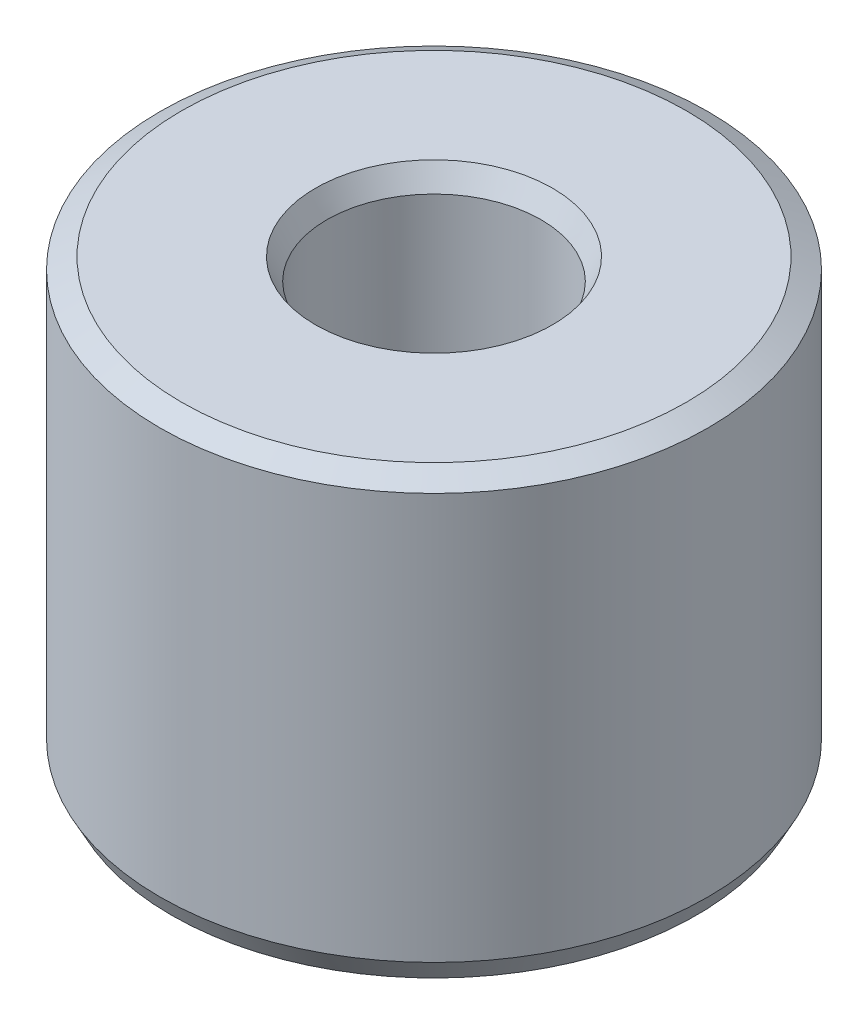
ISO-10303-21;
HEADER;
FILE_DESCRIPTION(('STEP AP214'),'2;1');
FILE_NAME('part.step','',(''),(''),'','','');
FILE_SCHEMA(('AUTOMOTIVE_DESIGN { 1 0 10303 214 1 1 1 1 }'));
ENDSEC;
DATA;
#1=APPLICATION_CONTEXT('core data for automotive mechanical design processes');
#2=APPLICATION_PROTOCOL_DEFINITION('international standard','automotive_design',2000,#1);
#3=PRODUCT_CONTEXT('',#1,'mechanical');
#4=PRODUCT('Part','Part','',(#3));
#5=PRODUCT_RELATED_PRODUCT_CATEGORY('part','',(#4));
#6=PRODUCT_DEFINITION_FORMATION('','',#4);
#7=PRODUCT_DEFINITION_CONTEXT('part definition',#1,'design');
#8=PRODUCT_DEFINITION('design','',#6,#7);
#9=PRODUCT_DEFINITION_SHAPE('','',#8);
#10=(LENGTH_UNIT() NAMED_UNIT(*) SI_UNIT(.MILLI.,.METRE.));
#11=(NAMED_UNIT(*) PLANE_ANGLE_UNIT() SI_UNIT($,.RADIAN.));
#12=(NAMED_UNIT(*) SI_UNIT($,.STERADIAN.) SOLID_ANGLE_UNIT());
#13=UNCERTAINTY_MEASURE_WITH_UNIT(LENGTH_MEASURE(1.E-05),#10,'distance_accuracy_value','');
#14=(GEOMETRIC_REPRESENTATION_CONTEXT(3) GLOBAL_UNCERTAINTY_ASSIGNED_CONTEXT((#13)) GLOBAL_UNIT_ASSIGNED_CONTEXT((#10,
#11,#12)) REPRESENTATION_CONTEXT('',''));
#15=CARTESIAN_POINT('',(0.,0.,0.));
#16=DIRECTION('',(0.,0.,1.));
#17=DIRECTION('',(1.,0.,0.));
#18=AXIS2_PLACEMENT_3D('',#15,#16,#17);
#19=CARTESIAN_POINT('',(0.,72.1281122933786,0.));
#20=DIRECTION('',(0.,-1.,0.));
#21=DIRECTION('',(0.,0.,-1.));
#22=AXIS2_PLACEMENT_3D('',#19,#20,#21);
#23=CYLINDRICAL_SURFACE('',#22,45.);
#24=CARTESIAN_POINT('',(0.,3.54116058245235,0.));
#25=DIRECTION('',(0.,1.,0.));
#26=DIRECTION('',(0.,0.,1.));
#27=AXIS2_PLACEMENT_3D('',#24,#25,#26);
#28=CIRCLE('',#27,45.);
#29=CARTESIAN_POINT('',(0.,3.54116058245235,45.));
#30=VERTEX_POINT('',#29);
#31=EDGE_CURVE('E10',#30,#30,#28,.T.);
#32=ORIENTED_EDGE('',*,*,#31,.T.);
#33=EDGE_LOOP('',(#32));
#34=FACE_BOUND('',#33,.T.);
#35=CARTESIAN_POINT('',(0.,70.2473704190509,0.));
#36=DIRECTION('',(0.,1.,0.));
#37=DIRECTION('',(0.,0.,1.));
#38=AXIS2_PLACEMENT_3D('',#35,#36,#37);
#39=CIRCLE('',#38,45.);
#40=CARTESIAN_POINT('',(0.,70.2473704190509,45.));
#41=VERTEX_POINT('',#40);
#42=EDGE_CURVE('E50',#41,#41,#39,.F.);
#43=ORIENTED_EDGE('',*,*,#42,.T.);
#44=EDGE_LOOP('',(#43));
#45=FACE_BOUND('',#44,.T.);
#46=ADVANCED_FACE('F39',(#34,#45),#23,.T.);
#47=CARTESIAN_POINT('',(0.,72.1281122933786,0.));
#48=DIRECTION('',(0.,1.,0.));
#49=DIRECTION('',(0.,0.,1.));
#50=AXIS2_PLACEMENT_3D('',#47,#48,#49);
#51=PLANE('',#50);
#52=CARTESIAN_POINT('',(0.,72.1281122933786,0.));
#53=DIRECTION('',(0.,1.,0.));
#54=DIRECTION('',(0.,0.,1.));
#55=AXIS2_PLACEMENT_3D('',#52,#53,#54);
#56=CIRCLE('',#55,19.4578587631629);
#57=CARTESIAN_POINT('',(0.,72.1281122933786,19.4578587631629));
#58=VERTEX_POINT('',#57);
#59=EDGE_CURVE('E58',#58,#58,#56,.F.);
#60=ORIENTED_EDGE('',*,*,#59,.T.);
#61=EDGE_LOOP('',(#60));
#62=FACE_BOUND('',#61,.T.);
#63=CARTESIAN_POINT('',(0.,72.1281122933786,0.));
#64=DIRECTION('',(0.,1.,0.));
#65=DIRECTION('',(0.,0.,1.));
#66=AXIS2_PLACEMENT_3D('',#63,#64,#65);
#67=CIRCLE('',#66,41.4588394175476);
#68=CARTESIAN_POINT('',(0.,72.1281122933786,41.4588394175476));
#69=VERTEX_POINT('',#68);
#70=EDGE_CURVE('E61',#69,#69,#67,.T.);
#71=ORIENTED_EDGE('',*,*,#70,.T.);
#72=EDGE_LOOP('',(#71));
#73=FACE_BOUND('',#72,.T.);
#74=ADVANCED_FACE('F88',(#62,#73),#51,.T.);
#75=CARTESIAN_POINT('',(0.,0.,0.));
#76=DIRECTION('',(0.,1.,0.));
#77=DIRECTION('',(0.,0.,1.));
#78=AXIS2_PLACEMENT_3D('',#75,#76,#77);
#79=PLANE('',#78);
#80=CARTESIAN_POINT('',(0.,0.,0.));
#81=DIRECTION('',(0.,1.,0.));
#82=DIRECTION('',(0.,0.,1.));
#83=AXIS2_PLACEMENT_3D('',#80,#81,#82);
#84=CIRCLE('',#83,21.1182774712876);
#85=CARTESIAN_POINT('',(0.,0.,-21.1182774712876));
#86=VERTEX_POINT('',#85);
#87=EDGE_CURVE('E51',#86,#86,#84,.T.);
#88=ORIENTED_EDGE('',*,*,#87,.T.);
#89=EDGE_LOOP('',(#88));
#90=FACE_BOUND('',#89,.T.);
#91=CARTESIAN_POINT('',(0.,0.,0.));
#92=DIRECTION('',(0.,1.,0.));
#93=DIRECTION('',(0.,0.,1.));
#94=AXIS2_PLACEMENT_3D('',#91,#92,#93);
#95=CIRCLE('',#94,43.1192581256723);
#96=CARTESIAN_POINT('',(0.,0.,43.1192581256723));
#97=VERTEX_POINT('',#96);
#98=EDGE_CURVE('E54',#97,#97,#95,.F.);
#99=ORIENTED_EDGE('',*,*,#98,.T.);
#100=EDGE_LOOP('',(#99));
#101=FACE_BOUND('',#100,.T.);
#102=ADVANCED_FACE('F83',(#90,#101),#79,.F.);
#103=CARTESIAN_POINT('',(0.,72.1281122933786,0.));
#104=DIRECTION('',(0.,-1.,0.));
#105=DIRECTION('',(0.,0.,-1.));
#106=AXIS2_PLACEMENT_3D('',#103,#104,#105);
#107=CYLINDRICAL_SURFACE('',#106,17.5771168888352);
#108=CARTESIAN_POINT('',(0.,68.5869517109262,0.));
#109=DIRECTION('',(0.,1.,0.));
#110=DIRECTION('',(0.,0.,1.));
#111=AXIS2_PLACEMENT_3D('',#108,#109,#110);
#112=CIRCLE('',#111,17.5771168888352);
#113=CARTESIAN_POINT('',(0.,68.5869517109262,17.5771168888352));
#114=VERTEX_POINT('',#113);
#115=EDGE_CURVE('E67',#114,#114,#112,.T.);
#116=ORIENTED_EDGE('',*,*,#115,.T.);
#117=EDGE_LOOP('',(#116));
#118=FACE_BOUND('',#117,.T.);
#119=CARTESIAN_POINT('',(0.,1.8807418743277,0.));
#120=DIRECTION('',(0.,1.,0.));
#121=DIRECTION('',(0.,0.,1.));
#122=AXIS2_PLACEMENT_3D('',#119,#120,#121);
#123=CIRCLE('',#122,17.5771168888352);
#124=CARTESIAN_POINT('',(0.,1.8807418743277,-17.5771168888352));
#125=VERTEX_POINT('',#124);
#126=EDGE_CURVE('E69',#125,#125,#123,.F.);
#127=ORIENTED_EDGE('',*,*,#126,.T.);
#128=EDGE_LOOP('',(#127));
#129=FACE_BOUND('',#128,.T.);
#130=ADVANCED_FACE('F71',(#118,#129),#107,.F.);
#131=CARTESIAN_POINT('',(0.,68.5869517109262,0.));
#132=DIRECTION('',(0.,1.,0.));
#133=DIRECTION('',(0.,0.,1.));
#134=AXIS2_PLACEMENT_3D('',#131,#132,#133);
#135=CONICAL_SURFACE('',#134,17.5771168888352,0.488223895645857);
#136=ORIENTED_EDGE('',*,*,#59,.F.);
#137=EDGE_LOOP('',(#136));
#138=FACE_BOUND('',#137,.T.);
#139=ORIENTED_EDGE('',*,*,#115,.F.);
#140=EDGE_LOOP('',(#139));
#141=FACE_BOUND('',#140,.T.);
#142=ADVANCED_FACE('F77',(#138,#141),#135,.F.);
#143=CARTESIAN_POINT('',(0.,0.,0.));
#144=DIRECTION('',(0.,-1.,0.));
#145=DIRECTION('',(0.,0.,-1.));
#146=AXIS2_PLACEMENT_3D('',#143,#144,#145);
#147=CONICAL_SURFACE('',#146,21.1182774712876,1.08257243114904);
#148=CARTESIAN_POINT('',(0.,1.8807418743277,-17.5771168888352));
#149=CARTESIAN_POINT('',(0.,1.86115081313679,-17.6140039782358));
#150=CARTESIAN_POINT('',(0.,1.84155975194587,-17.6508910676363));
#151=CARTESIAN_POINT('',(0.,1.80237762956404,-17.7246652464374));
#152=CARTESIAN_POINT('',(0.,1.78278656837313,-17.7615523358379));
#153=CARTESIAN_POINT('',(0.,1.7436044459913,-17.835326514639));
#154=CARTESIAN_POINT('',(0.,1.72401338480039,-17.8722136040396));
#155=CARTESIAN_POINT('',(0.,1.68483126241856,-17.9459877828407));
#156=CARTESIAN_POINT('',(0.,1.66524020122765,-17.9828748722412));
#157=CARTESIAN_POINT('',(0.,1.62605807884582,-18.0566490510423));
#158=CARTESIAN_POINT('',(0.,1.60646701765491,-18.0935361404428));
#159=CARTESIAN_POINT('',(0.,1.56728489527308,-18.1673103192439));
#160=CARTESIAN_POINT('',(0.,1.54769383408217,-18.2041974086445));
#161=CARTESIAN_POINT('',(0.,1.50851171170034,-18.2779715874456));
#162=CARTESIAN_POINT('',(0.,1.48892065050943,-18.3148586768461));
#163=CARTESIAN_POINT('',(0.,1.4497385281276,-18.3886328556472));
#164=CARTESIAN_POINT('',(0.,1.43014746693669,-18.4255199450478));
#165=CARTESIAN_POINT('',(0.,1.39096534455486,-18.4992941238488));
#166=CARTESIAN_POINT('',(0.,1.37137428336395,-18.5361812132494));
#167=CARTESIAN_POINT('',(0.,1.33219216098212,-18.6099553920505));
#168=CARTESIAN_POINT('',(0.,1.31260109979121,-18.646842481451));
#169=CARTESIAN_POINT('',(0.,1.27341897740938,-18.7206166602521));
#170=CARTESIAN_POINT('',(0.,1.25382791621847,-18.7575037496527));
#171=CARTESIAN_POINT('',(0.,1.21464579383664,-18.8312779284538));
#172=CARTESIAN_POINT('',(0.,1.19505473264573,-18.8681650178543));
#173=CARTESIAN_POINT('',(0.,1.1558726102639,-18.9419391966554));
#174=CARTESIAN_POINT('',(0.,1.13628154907298,-18.9788262860559));
#175=CARTESIAN_POINT('',(0.,1.09709942669116,-19.052600464857));
#176=CARTESIAN_POINT('',(0.,1.07750836550024,-19.0894875542576));
#177=CARTESIAN_POINT('',(0.,1.03832624311842,-19.1632617330587));
#178=CARTESIAN_POINT('',(0.,1.0187351819275,-19.2001488224592));
#179=CARTESIAN_POINT('',(0.,0.979553059545676,-19.2739230012603));
#180=CARTESIAN_POINT('',(0.,0.959961998354763,-19.3108100906608));
#181=CARTESIAN_POINT('',(0.,0.920779875972936,-19.3845842694619));
#182=CARTESIAN_POINT('',(0.,0.901188814782022,-19.4214713588625));
#183=CARTESIAN_POINT('',(0.,0.862006692400195,-19.4952455376636));
#184=CARTESIAN_POINT('',(0.,0.842415631209281,-19.5321326270641));
#185=CARTESIAN_POINT('',(0.,0.803233508827454,-19.6059068058652));
#186=CARTESIAN_POINT('',(0.,0.783642447636541,-19.6427938952658));
#187=CARTESIAN_POINT('',(0.,0.744460325254714,-19.7165680740668));
#188=CARTESIAN_POINT('',(0.,0.724869264063801,-19.7534551634674));
#189=CARTESIAN_POINT('',(0.,0.685687141681973,-19.8272293422685));
#190=CARTESIAN_POINT('',(0.,0.66609608049106,-19.864116431669));
#191=CARTESIAN_POINT('',(0.,0.626913958109233,-19.9378906104701));
#192=CARTESIAN_POINT('',(0.,0.607322896918319,-19.9747776998707));
#193=CARTESIAN_POINT('',(0.,0.568140774536492,-20.0485518786718));
#194=CARTESIAN_POINT('',(0.,0.548549713345579,-20.0854389680723));
#195=CARTESIAN_POINT('',(0.,0.509367590963752,-20.1592131468734));
#196=CARTESIAN_POINT('',(0.,0.489776529772838,-20.1961002362739));
#197=CARTESIAN_POINT('',(0.,0.450594407391011,-20.269874415075));
#198=CARTESIAN_POINT('',(0.,0.431003346200098,-20.3067615044756));
#199=CARTESIAN_POINT('',(0.,0.39182122381827,-20.3805356832767));
#200=CARTESIAN_POINT('',(0.,0.372230162627357,-20.4174227726772));
#201=CARTESIAN_POINT('',(0.,0.33304804024553,-20.4911969514783));
#202=CARTESIAN_POINT('',(0.,0.313456979054617,-20.5280840408789));
#203=CARTESIAN_POINT('',(0.,0.27427485667279,-20.6018582196799));
#204=CARTESIAN_POINT('',(0.,0.254683795481876,-20.6387453090805));
#205=CARTESIAN_POINT('',(0.,0.215501673100049,-20.7125194878816));
#206=CARTESIAN_POINT('',(0.,0.195910611909135,-20.7494065772821));
#207=CARTESIAN_POINT('',(0.,0.156728489527308,-20.8231807560832));
#208=CARTESIAN_POINT('',(0.,0.137137428336395,-20.8600678454838));
#209=CARTESIAN_POINT('',(0.,0.097955305954568,-20.9338420242849));
#210=CARTESIAN_POINT('',(0.,0.0783642447636543,-20.9707291136854));
#211=CARTESIAN_POINT('',(0.,0.0391821223818269,-21.0445032924865));
#212=CARTESIAN_POINT('',(0.,0.0195910611909132,-21.081390381887));
#213=CARTESIAN_POINT('',(0.,0.,-21.1182774712876));
#214=B_SPLINE_CURVE_WITH_KNOTS('',3,(#148,#149,#150,#151,#152,#153,#154,#155,#156,#157,#158,
#159,#160,#161,#162,#163,#164,#165,#166,#167,#168,#169,#170,#171,#172,#173,#174,#175,#176,#177,
#178,#179,#180,#181,#182,#183,#184,#185,#186,#187,#188,#189,#190,#191,#192,#193,#194,#195,#196,
#197,#198,#199,#200,#201,#202,#203,#204,#205,#206,#207,#208,#209,#210,#211,#212,#213),
.UNSPECIFIED.,.F.,.F.,(4,2,2,2,2,2,2,2,2,2,2,2,2,2,2,2,2,2,2,2,2,2,2,2,2,2,2,2,2,2,2,2,4),(0.,
0.125300452462349,0.250600904924699,0.375901357387051,0.5012018098494,0.62650226231175,
0.751802714774102,0.877103167236452,1.0024036196988,1.12770407216115,1.2530045246235,
1.37830497708585,1.5036054295482,1.62890588201055,1.7542063344729,1.87950678693525,
2.0048072393976,2.13010769185995,2.2554081443223,2.38070859678465,2.506009049247,
2.63130950170935,2.7566099541717,2.88191040663405,3.0072108590964,3.13251131155875,
3.2578117640211,3.38311221648345,3.5084126689458,3.63371312140815,3.7590135738705,
3.88431402633285,4.0096144787952),.UNSPECIFIED.);
#215=EDGE_CURVE('BSEAM73',#125,#86,#214,.T.);
#216=ORIENTED_EDGE('',*,*,#126,.F.);
#217=ORIENTED_EDGE('',*,*,#87,.F.);
#218=ORIENTED_EDGE('',*,*,#215,.T.);
#219=ORIENTED_EDGE('',*,*,#215,.F.);
#220=EDGE_LOOP('',(#216,#218,#217,#219));
#221=FACE_BOUND('',#220,.T.);
#222=ADVANCED_FACE('F73',(#221),#147,.F.);
#223=CARTESIAN_POINT('',(0.,3.54116058245235,0.));
#224=DIRECTION('',(0.,1.,0.));
#225=DIRECTION('',(0.,0.,1.));
#226=AXIS2_PLACEMENT_3D('',#223,#224,#225);
#227=CONICAL_SURFACE('',#226,45.,0.48822389564586);
#228=ORIENTED_EDGE('',*,*,#98,.F.);
#229=EDGE_LOOP('',(#228));
#230=FACE_BOUND('',#229,.T.);
#231=ORIENTED_EDGE('',*,*,#31,.F.);
#232=EDGE_LOOP('',(#231));
#233=FACE_BOUND('',#232,.T.);
#234=ADVANCED_FACE('F76',(#230,#233),#227,.T.);
#235=CARTESIAN_POINT('',(0.,72.1281122933786,0.));
#236=DIRECTION('',(0.,-1.,0.));
#237=DIRECTION('',(0.,0.,-1.));
#238=AXIS2_PLACEMENT_3D('',#235,#236,#237);
#239=CONICAL_SURFACE('',#238,41.4588394175476,1.08257243114904);
#240=ORIENTED_EDGE('',*,*,#42,.F.);
#241=EDGE_LOOP('',(#240));
#242=FACE_BOUND('',#241,.T.);
#243=ORIENTED_EDGE('',*,*,#70,.F.);
#244=EDGE_LOOP('',(#243));
#245=FACE_BOUND('',#244,.T.);
#246=ADVANCED_FACE('F45',(#242,#245),#239,.T.);
#247=CLOSED_SHELL('',(#46,#74,#102,#130,#142,#222,#234,#246));
#248=MANIFOLD_SOLID_BREP('B2',#247);
#249=ADVANCED_BREP_SHAPE_REPRESENTATION('',(#18,#248),#14);
#250=SHAPE_DEFINITION_REPRESENTATION(#9,#249);
ENDSEC;
END-ISO-10303-21;
